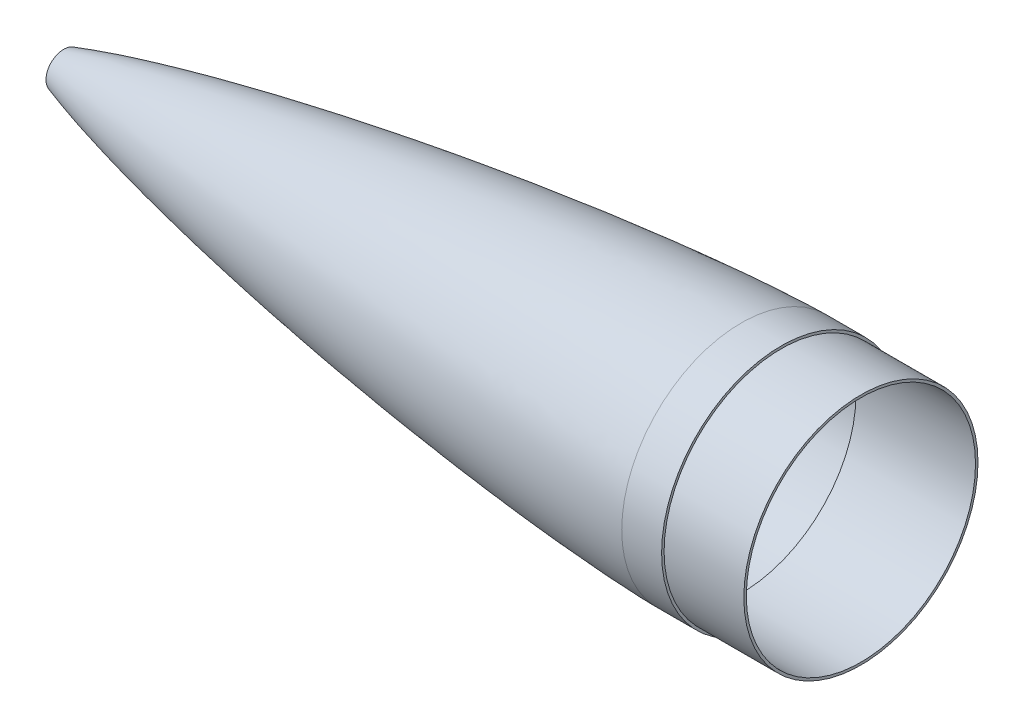
ISO-10303-21;
HEADER;
FILE_DESCRIPTION(('STEP AP214'),'2;1');
FILE_NAME('part.step','',(''),(''),'','','');
FILE_SCHEMA(('AUTOMOTIVE_DESIGN { 1 0 10303 214 1 1 1 1 }'));
ENDSEC;
DATA;
#1=APPLICATION_CONTEXT('core data for automotive mechanical design processes');
#2=APPLICATION_PROTOCOL_DEFINITION('international standard','automotive_design',2000,#1);
#3=PRODUCT_CONTEXT('',#1,'mechanical');
#4=PRODUCT('Part','Part','',(#3));
#5=PRODUCT_RELATED_PRODUCT_CATEGORY('part','',(#4));
#6=PRODUCT_DEFINITION_FORMATION('','',#4);
#7=PRODUCT_DEFINITION_CONTEXT('part definition',#1,'design');
#8=PRODUCT_DEFINITION('design','',#6,#7);
#9=PRODUCT_DEFINITION_SHAPE('','',#8);
#10=(LENGTH_UNIT() NAMED_UNIT(*) SI_UNIT(.MILLI.,.METRE.));
#11=(NAMED_UNIT(*) PLANE_ANGLE_UNIT() SI_UNIT($,.RADIAN.));
#12=(NAMED_UNIT(*) SI_UNIT($,.STERADIAN.) SOLID_ANGLE_UNIT());
#13=UNCERTAINTY_MEASURE_WITH_UNIT(LENGTH_MEASURE(1.E-05),#10,'distance_accuracy_value','');
#14=(GEOMETRIC_REPRESENTATION_CONTEXT(3) GLOBAL_UNCERTAINTY_ASSIGNED_CONTEXT((#13)) GLOBAL_UNIT_ASSIGNED_CONTEXT((#10,
#11,#12)) REPRESENTATION_CONTEXT('',''));
#15=CARTESIAN_POINT('',(0.,0.,0.));
#16=DIRECTION('',(0.,0.,1.));
#17=DIRECTION('',(1.,0.,0.));
#18=AXIS2_PLACEMENT_3D('',#15,#16,#17);
#19=CARTESIAN_POINT('',(914.4,152.4,0.));
#20=CARTESIAN_POINT('',(912.392227779895,152.393196616945,0.));
#21=CARTESIAN_POINT('',(908.376949057281,152.34086284496,0.));
#22=CARTESIAN_POINT('',(900.347440378893,152.177178216288,0.));
#23=CARTESIAN_POINT('',(884.932437089861,151.702539519313,0.));
#24=CARTESIAN_POINT('',(864.145536025305,150.817451897861,0.));
#25=CARTESIAN_POINT('',(830.615211008224,148.989503940475,0.));
#26=CARTESIAN_POINT('',(786.373789984961,145.92699027575,0.));
#27=CARTESIAN_POINT('',(742.180870701981,142.229994267103,0.));
#28=CARTESIAN_POINT('',(698.036524214112,138.001817701229,0.));
#29=CARTESIAN_POINT('',(661.282519218806,134.153873931979,0.));
#30=CARTESIAN_POINT('',(631.899420180122,130.889153603625,0.));
#31=CARTESIAN_POINT('',(602.536868800566,127.444739671676,0.));
#32=CARTESIAN_POINT('',(573.195426969664,123.824880029641,0.));
#33=CARTESIAN_POINT('',(543.875783342798,120.032588185734,0.));
#34=CARTESIAN_POINT('',(514.578772116379,116.06922658619,0.));
#35=CARTESIAN_POINT('',(485.305388677866,111.934967932419,0.));
#36=CARTESIAN_POINT('',(456.056824987134,107.628600482448,0.));
#37=CARTESIAN_POINT('',(426.834492225895,103.147632174954,0.));
#38=CARTESIAN_POINT('',(397.640090517629,98.4881212424317,0.));
#39=CARTESIAN_POINT('',(372.12119263108,94.2500038951667,0.));
#40=CARTESIAN_POINT('',(350.268122203351,90.4977143115936,0.));
#41=CARTESIAN_POINT('',(328.432361695576,86.6461511337458,0.));
#42=CARTESIAN_POINT('',(306.614812157902,82.6926113250093,0.));
#43=CARTESIAN_POINT('',(281.189453130926,77.9247001502588,0.));
#44=CARTESIAN_POINT('',(255.802551989387,72.9565760028741,0.));
#45=CARTESIAN_POINT('',(234.073297095524,68.542392146972,0.));
#46=CARTESIAN_POINT('',(215.989084390203,64.7518245817312,0.));
#47=CARTESIAN_POINT('',(201.536340401117,61.6480154146005,0.));
#48=CARTESIAN_POINT('',(187.101006340876,58.468808184755,0.));
#49=CARTESIAN_POINT('',(172.68205782738,55.2080172049701,0.));
#50=CARTESIAN_POINT('',(158.285989872229,51.8608398529736,0.));
#51=CARTESIAN_POINT('',(143.907449645734,48.4171671079753,0.));
#52=CARTESIAN_POINT('',(130.42389904338,45.0849744198117,0.));
#53=CARTESIAN_POINT('',(117.812200958938,41.8678314419505,0.));
#54=CARTESIAN_POINT('',(106.104903015947,38.7887065594672,0.));
#55=CARTESIAN_POINT('',(95.241355254957,35.8415203642148,0.));
#56=CARTESIAN_POINT('',(85.386033893784,33.0811028750847,0.));
#57=CARTESIAN_POINT('',(76.3897966894573,30.474842786227,0.));
#58=CARTESIAN_POINT('',(68.4729234618981,28.1134110935043,0.));
#59=CARTESIAN_POINT('',(62.1376278525513,26.1632455955183,0.));
#60=CARTESIAN_POINT('',(57.1138103418142,24.5816710907516,0.));
#61=CARTESIAN_POINT('',(53.2473666666007,23.3314437728572,0.));
#62=CARTESIAN_POINT('',(51.6259610199524,22.8019301879302,0.));
#63=CARTESIAN_POINT('',(50.7999999999976,22.5303567600822,0.));
#64=B_SPLINE_CURVE_WITH_KNOTS('',4,(#19,#20,#21,#22,#23,#24,#25,#26,#27,#28,#29,#30,#31,#32,#33,
#34,#35,#36,#37,#38,#39,#40,#41,#42,#43,#44,#45,#46,#47,#48,#49,#50,#51,#52,#53,#54,#55,#56,#57,
#58,#59,#60,#61,#62,#63),.UNSPECIFIED.,.F.,.F.,(5,1,1,1,1,1,1,1,1,1,1,1,1,1,1,1,1,1,1,1,1,1,1,1,
1,1,1,1,1,1,1,1,1,1,1,1,1,1,1,1,1,5),(0.0588883630523136,0.0675235628254177,0.0761587625985218,
0.0934291621447302,0.125216709277137,0.157004256409545,0.220579351897685,0.284154445828984,
0.315941992861317,0.34772953989365,0.379517087084872,0.411304634276095,0.443092182179722,
0.474879730083349,0.506667276356566,0.538454822629782,0.570242369431864,0.602029916233946,
0.633817463192602,0.665605010151258,0.681498783965413,0.697392557779567,0.729180105407877,
0.760967651961502,0.792755198515127,0.8086489718625,0.824542745209872,0.840436518557245,
0.856330291904618,0.872224064530574,0.888117837156529,0.904011609782485,0.91990538240844,
0.93198214388297,0.9440589053575,0.956135666832029,0.968212428306559,0.976159321229919,
0.984106214153279,0.99205310707664,0.99602655353832,1.),.UNSPECIFIED.);
#65=CARTESIAN_POINT('',(-61.6447250102164,0.,0.));
#66=DIRECTION('',(-1.,0.,0.));
#67=AXIS1_PLACEMENT('',#65,#66);
#68=SURFACE_OF_REVOLUTION('',#64,#67);
#69=CARTESIAN_POINT('',(50.8,0.,0.));
#70=DIRECTION('',(-1.,0.,0.));
#71=DIRECTION('',(0.,0.,1.));
#72=AXIS2_PLACEMENT_3D('',#69,#70,#71);
#73=CIRCLE('',#72,22.530356760083);
#74=CARTESIAN_POINT('',(50.8,0.,22.530356760083));
#75=VERTEX_POINT('',#74);
#76=EDGE_CURVE('E10',#75,#75,#73,.T.);
#77=ORIENTED_EDGE('',*,*,#76,.F.);
#78=EDGE_LOOP('',(#77));
#79=FACE_BOUND('',#78,.T.);
#80=CARTESIAN_POINT('',(914.4,0.,0.));
#81=DIRECTION('',(-1.,0.,0.));
#82=DIRECTION('',(0.,0.,1.));
#83=AXIS2_PLACEMENT_3D('',#80,#81,#82);
#84=CIRCLE('',#83,152.4);
#85=CARTESIAN_POINT('',(914.4,0.,152.4));
#86=VERTEX_POINT('',#85);
#87=EDGE_CURVE('E69',#86,#86,#84,.T.);
#88=ORIENTED_EDGE('',*,*,#87,.T.);
#89=EDGE_LOOP('',(#88));
#90=FACE_BOUND('',#89,.T.);
#91=ADVANCED_FACE('F31',(#79,#90),#68,.T.);
#92=CARTESIAN_POINT('',(50.799999999999,22.530356760083,0.));
#93=DIRECTION('',(1.,0.,0.));
#94=DIRECTION('',(0.,0.,-1.));
#95=AXIS2_PLACEMENT_3D('',#92,#93,#94);
#96=PLANE('',#95);
#97=CARTESIAN_POINT('',(50.799999999998,0.,0.));
#98=DIRECTION('',(-1.,0.,0.));
#99=DIRECTION('',(0.,0.,1.));
#100=AXIS2_PLACEMENT_3D('',#97,#98,#99);
#101=CIRCLE('',#100,6.35);
#102=CARTESIAN_POINT('',(50.799999999998,0.,6.35));
#103=VERTEX_POINT('',#102);
#104=EDGE_CURVE('E38',#103,#103,#101,.T.);
#105=ORIENTED_EDGE('',*,*,#104,.F.);
#106=EDGE_LOOP('',(#105));
#107=FACE_BOUND('',#106,.T.);
#108=ORIENTED_EDGE('',*,*,#76,.T.);
#109=EDGE_LOOP('',(#108));
#110=FACE_BOUND('',#109,.T.);
#111=ADVANCED_FACE('F95',(#107,#110),#96,.F.);
#112=CARTESIAN_POINT('',(-61.6447250102164,0.,0.));
#113=DIRECTION('',(-1.,0.,0.));
#114=DIRECTION('',(0.,0.,1.));
#115=AXIS2_PLACEMENT_3D('',#112,#113,#114);
#116=CYLINDRICAL_SURFACE('',#115,6.35);
#117=CARTESIAN_POINT('',(53.974999999998,0.,0.));
#118=DIRECTION('',(-1.,0.,0.));
#119=DIRECTION('',(0.,0.,1.));
#120=AXIS2_PLACEMENT_3D('',#117,#118,#119);
#121=CIRCLE('',#120,6.35);
#122=CARTESIAN_POINT('',(53.974999999998,0.,6.35));
#123=VERTEX_POINT('',#122);
#124=EDGE_CURVE('E42',#123,#123,#121,.T.);
#125=ORIENTED_EDGE('',*,*,#124,.F.);
#126=EDGE_LOOP('',(#125));
#127=FACE_BOUND('',#126,.T.);
#128=ORIENTED_EDGE('',*,*,#104,.T.);
#129=EDGE_LOOP('',(#128));
#130=FACE_BOUND('',#129,.T.);
#131=ADVANCED_FACE('F92',(#127,#130),#116,.F.);
#132=CARTESIAN_POINT('',(53.974999999998,6.35,0.));
#133=DIRECTION('',(-1.,0.,0.));
#134=DIRECTION('',(0.,0.,1.));
#135=AXIS2_PLACEMENT_3D('',#132,#133,#134);
#136=PLANE('',#135);
#137=CARTESIAN_POINT('',(53.9749999999979,0.,0.));
#138=DIRECTION('',(-1.,0.,0.));
#139=DIRECTION('',(0.,0.,1.));
#140=AXIS2_PLACEMENT_3D('',#137,#138,#139);
#141=CIRCLE('',#140,20.2275659160451);
#142=CARTESIAN_POINT('',(53.9749999999979,0.,20.2275659160451));
#143=VERTEX_POINT('',#142);
#144=EDGE_CURVE('E46',#143,#143,#141,.T.);
#145=ORIENTED_EDGE('',*,*,#144,.F.);
#146=EDGE_LOOP('',(#145));
#147=FACE_BOUND('',#146,.T.);
#148=ORIENTED_EDGE('',*,*,#124,.T.);
#149=EDGE_LOOP('',(#148));
#150=FACE_BOUND('',#149,.T.);
#151=ADVANCED_FACE('F87',(#147,#150),#136,.F.);
#152=CARTESIAN_POINT('',(51.7917004793821,19.5142076989135,0.));
#153=CARTESIAN_POINT('',(52.3018116530098,19.6819306745247,0.));
#154=CARTESIAN_POINT('',(53.3013675448014,20.009050316785,0.));
#155=CARTESIAN_POINT('',(54.9287380032872,20.537379045564,0.));
#156=CARTESIAN_POINT('',(56.636149311043,21.0877253473114,0.));
#157=CARTESIAN_POINT('',(58.867170375928,21.8010207404776,0.));
#158=CARTESIAN_POINT('',(61.5224210460252,22.6386828826855,0.));
#159=CARTESIAN_POINT('',(64.7365078372813,23.6378121571205,0.));
#160=CARTESIAN_POINT('',(68.0235415360538,24.6466091825375,0.));
#161=CARTESIAN_POINT('',(72.3943892602977,25.969741612406,0.));
#162=CARTESIAN_POINT('',(77.8023258945766,27.5731996326516,0.));
#163=CARTESIAN_POINT('',(84.3722996695639,29.477097547899,0.));
#164=CARTESIAN_POINT('',(93.118193972625,31.9541076445145,0.));
#165=CARTESIAN_POINT('',(108.466778526058,36.1651972886272,0.));
#166=CARTESIAN_POINT('',(130.491628822911,41.8757451084428,0.));
#167=CARTESIAN_POINT('',(165.870302672669,50.4899263137156,0.));
#168=CARTESIAN_POINT('',(210.303076360602,60.4493795414101,0.));
#169=CARTESIAN_POINT('',(281.693068547813,75.0679852531733,0.));
#170=CARTESIAN_POINT('',(371.347473816087,91.310304543721,0.));
#171=CARTESIAN_POINT('',(479.374979470713,108.229836310879,0.));
#172=CARTESIAN_POINT('',(569.684892551724,120.376775067863,0.));
#173=CARTESIAN_POINT('',(642.076792345323,128.912483065256,0.));
#174=CARTESIAN_POINT('',(696.438363768911,134.692640497937,0.));
#175=CARTESIAN_POINT('',(750.863527691906,139.800693107421,0.));
#176=CARTESIAN_POINT('',(796.267539796297,143.425218790408,0.));
#177=CARTESIAN_POINT('',(832.617797312864,145.860290015131,0.));
#178=CARTESIAN_POINT('',(859.890749046982,147.416222505912,0.));
#179=CARTESIAN_POINT('',(882.628689992933,148.436275801494,0.));
#180=CARTESIAN_POINT('',(898.534123580479,148.946546098229,0.));
#181=CARTESIAN_POINT('',(907.627696219565,149.150954449313,0.));
#182=CARTESIAN_POINT('',(912.147317849634,149.217348506161,0.));
#183=CARTESIAN_POINT('',(914.41075849988,149.225018227662,0.));
#184=B_SPLINE_CURVE_WITH_KNOTS('',3,(#152,#153,#154,#155,#156,#157,#158,#159,#160,#161,#162,
#163,#164,#165,#166,#167,#168,#169,#170,#171,#172,#173,#174,#175,#176,#177,#178,#179,#180,#181,
#182,#183),.UNSPECIFIED.,.F.,.F.,(4,1,1,1,1,1,1,1,1,1,1,1,1,1,1,1,1,1,1,1,1,1,1,1,1,1,1,1,1,4),
(0.0588883630523136,0.060726471718227,0.0625645803841405,0.0644026890500539,0.0662407977159674,
0.0699170150477943,0.0735932323796212,0.0772694497114481,0.080945667043275,0.0882981017069288,
0.0956505363705826,0.103002971034236,0.117707840361544,0.147117579016159,0.176527317670774,
0.235346794980005,0.294166272289235,0.411805226907696,0.529444181526157,0.647083136144618,
0.705902613453848,0.764722090763078,0.823541568072309,0.882361045381539,0.911770784036154,
0.94118052269077,0.970590261345385,0.985295130672692,0.992647565336346,1.),.UNSPECIFIED.);
#185=CARTESIAN_POINT('',(-61.6447250102164,0.,0.));
#186=DIRECTION('',(-1.,0.,0.));
#187=AXIS1_PLACEMENT('',#185,#186);
#188=SURFACE_OF_REVOLUTION('',#184,#187);
#189=CARTESIAN_POINT('',(914.41075849988,0.,0.));
#190=DIRECTION('',(-1.,0.,0.));
#191=DIRECTION('',(0.,0.,1.));
#192=AXIS2_PLACEMENT_3D('',#189,#190,#191);
#193=CIRCLE('',#192,149.225018227662);
#194=CARTESIAN_POINT('',(914.41075849988,0.,149.225018227662));
#195=VERTEX_POINT('',#194);
#196=EDGE_CURVE('E51',#195,#195,#193,.T.);
#197=ORIENTED_EDGE('',*,*,#196,.F.);
#198=EDGE_LOOP('',(#197));
#199=FACE_BOUND('',#198,.T.);
#200=ORIENTED_EDGE('',*,*,#144,.T.);
#201=EDGE_LOOP('',(#200));
#202=FACE_BOUND('',#201,.T.);
#203=ADVANCED_FACE('F82',(#199,#202),#188,.T.);
#204=CARTESIAN_POINT('',(914.41075849988,146.05,0.));
#205=DIRECTION('',(1.,0.,0.));
#206=DIRECTION('',(0.,0.,-1.));
#207=AXIS2_PLACEMENT_3D('',#204,#205,#206);
#208=PLANE('',#207);
#209=CARTESIAN_POINT('',(914.41075849988,0.,0.));
#210=DIRECTION('',(-1.,0.,0.));
#211=DIRECTION('',(0.,0.,1.));
#212=AXIS2_PLACEMENT_3D('',#209,#210,#211);
#213=CIRCLE('',#212,146.05);
#214=CARTESIAN_POINT('',(914.41075849988,0.,146.05));
#215=VERTEX_POINT('',#214);
#216=EDGE_CURVE('E54',#215,#215,#213,.T.);
#217=ORIENTED_EDGE('',*,*,#216,.F.);
#218=EDGE_LOOP('',(#217));
#219=FACE_BOUND('',#218,.T.);
#220=ORIENTED_EDGE('',*,*,#196,.T.);
#221=EDGE_LOOP('',(#220));
#222=FACE_BOUND('',#221,.T.);
#223=ADVANCED_FACE('F86',(#219,#222),#208,.F.);
#224=CARTESIAN_POINT('',(-61.6447250102164,0.,0.));
#225=DIRECTION('',(-1.,0.,0.));
#226=DIRECTION('',(0.,0.,1.));
#227=AXIS2_PLACEMENT_3D('',#224,#225,#226);
#228=CYLINDRICAL_SURFACE('',#227,146.05);
#229=CARTESIAN_POINT('',(1066.8,0.,0.));
#230=DIRECTION('',(-1.,0.,0.));
#231=DIRECTION('',(0.,0.,1.));
#232=AXIS2_PLACEMENT_3D('',#229,#230,#231);
#233=CIRCLE('',#232,146.05);
#234=CARTESIAN_POINT('',(1066.8,0.,146.05));
#235=VERTEX_POINT('',#234);
#236=EDGE_CURVE('E57',#235,#235,#233,.T.);
#237=ORIENTED_EDGE('',*,*,#236,.F.);
#238=EDGE_LOOP('',(#237));
#239=FACE_BOUND('',#238,.T.);
#240=ORIENTED_EDGE('',*,*,#216,.T.);
#241=EDGE_LOOP('',(#240));
#242=FACE_BOUND('',#241,.T.);
#243=ADVANCED_FACE('F129',(#239,#242),#228,.F.);
#244=CARTESIAN_POINT('',(1066.8,149.225,0.));
#245=DIRECTION('',(-1.,0.,0.));
#246=DIRECTION('',(0.,0.,1.));
#247=AXIS2_PLACEMENT_3D('',#244,#245,#246);
#248=PLANE('',#247);
#249=CARTESIAN_POINT('',(1066.8,0.,0.));
#250=DIRECTION('',(-1.,0.,0.));
#251=DIRECTION('',(0.,0.,1.));
#252=AXIS2_PLACEMENT_3D('',#249,#250,#251);
#253=CIRCLE('',#252,149.225);
#254=CARTESIAN_POINT('',(1066.8,0.,149.225));
#255=VERTEX_POINT('',#254);
#256=EDGE_CURVE('E60',#255,#255,#253,.T.);
#257=ORIENTED_EDGE('',*,*,#256,.F.);
#258=EDGE_LOOP('',(#257));
#259=FACE_BOUND('',#258,.T.);
#260=ORIENTED_EDGE('',*,*,#236,.T.);
#261=EDGE_LOOP('',(#260));
#262=FACE_BOUND('',#261,.T.);
#263=ADVANCED_FACE('F123',(#259,#262),#248,.F.);
#264=CARTESIAN_POINT('',(-61.6447250102164,0.,0.));
#265=DIRECTION('',(-1.,0.,0.));
#266=DIRECTION('',(0.,0.,1.));
#267=AXIS2_PLACEMENT_3D('',#264,#265,#266);
#268=CYLINDRICAL_SURFACE('',#267,149.225);
#269=CARTESIAN_POINT('',(965.2,0.,0.));
#270=DIRECTION('',(-1.,0.,0.));
#271=DIRECTION('',(0.,0.,1.));
#272=AXIS2_PLACEMENT_3D('',#269,#270,#271);
#273=CIRCLE('',#272,149.225);
#274=CARTESIAN_POINT('',(965.2,0.,149.225));
#275=VERTEX_POINT('',#274);
#276=EDGE_CURVE('E63',#275,#275,#273,.T.);
#277=ORIENTED_EDGE('',*,*,#276,.F.);
#278=EDGE_LOOP('',(#277));
#279=FACE_BOUND('',#278,.T.);
#280=ORIENTED_EDGE('',*,*,#256,.T.);
#281=EDGE_LOOP('',(#280));
#282=FACE_BOUND('',#281,.T.);
#283=ADVANCED_FACE('F117',(#279,#282),#268,.T.);
#284=CARTESIAN_POINT('',(965.2,152.4,0.));
#285=DIRECTION('',(-1.,0.,0.));
#286=DIRECTION('',(0.,0.,1.));
#287=AXIS2_PLACEMENT_3D('',#284,#285,#286);
#288=PLANE('',#287);
#289=CARTESIAN_POINT('',(965.2,0.,0.));
#290=DIRECTION('',(-1.,0.,0.));
#291=DIRECTION('',(0.,0.,1.));
#292=AXIS2_PLACEMENT_3D('',#289,#290,#291);
#293=CIRCLE('',#292,152.4);
#294=CARTESIAN_POINT('',(965.2,0.,152.4));
#295=VERTEX_POINT('',#294);
#296=EDGE_CURVE('E66',#295,#295,#293,.T.);
#297=ORIENTED_EDGE('',*,*,#296,.F.);
#298=EDGE_LOOP('',(#297));
#299=FACE_BOUND('',#298,.T.);
#300=ORIENTED_EDGE('',*,*,#276,.T.);
#301=EDGE_LOOP('',(#300));
#302=FACE_BOUND('',#301,.T.);
#303=ADVANCED_FACE('F111',(#299,#302),#288,.F.);
#304=CARTESIAN_POINT('',(-61.6447250102164,0.,0.));
#305=DIRECTION('',(-1.,0.,0.));
#306=DIRECTION('',(0.,0.,1.));
#307=AXIS2_PLACEMENT_3D('',#304,#305,#306);
#308=CYLINDRICAL_SURFACE('',#307,152.4);
#309=ORIENTED_EDGE('',*,*,#87,.F.);
#310=EDGE_LOOP('',(#309));
#311=FACE_BOUND('',#310,.T.);
#312=ORIENTED_EDGE('',*,*,#296,.T.);
#313=EDGE_LOOP('',(#312));
#314=FACE_BOUND('',#313,.T.);
#315=ADVANCED_FACE('F108',(#311,#314),#308,.T.);
#316=CLOSED_SHELL('',(#91,#111,#131,#151,#203,#223,#243,#263,#283,#303,#315));
#317=MANIFOLD_SOLID_BREP('B2',#316);
#318=ADVANCED_BREP_SHAPE_REPRESENTATION('',(#18,#317),#14);
#319=SHAPE_DEFINITION_REPRESENTATION(#9,#318);
ENDSEC;
END-ISO-10303-21;
